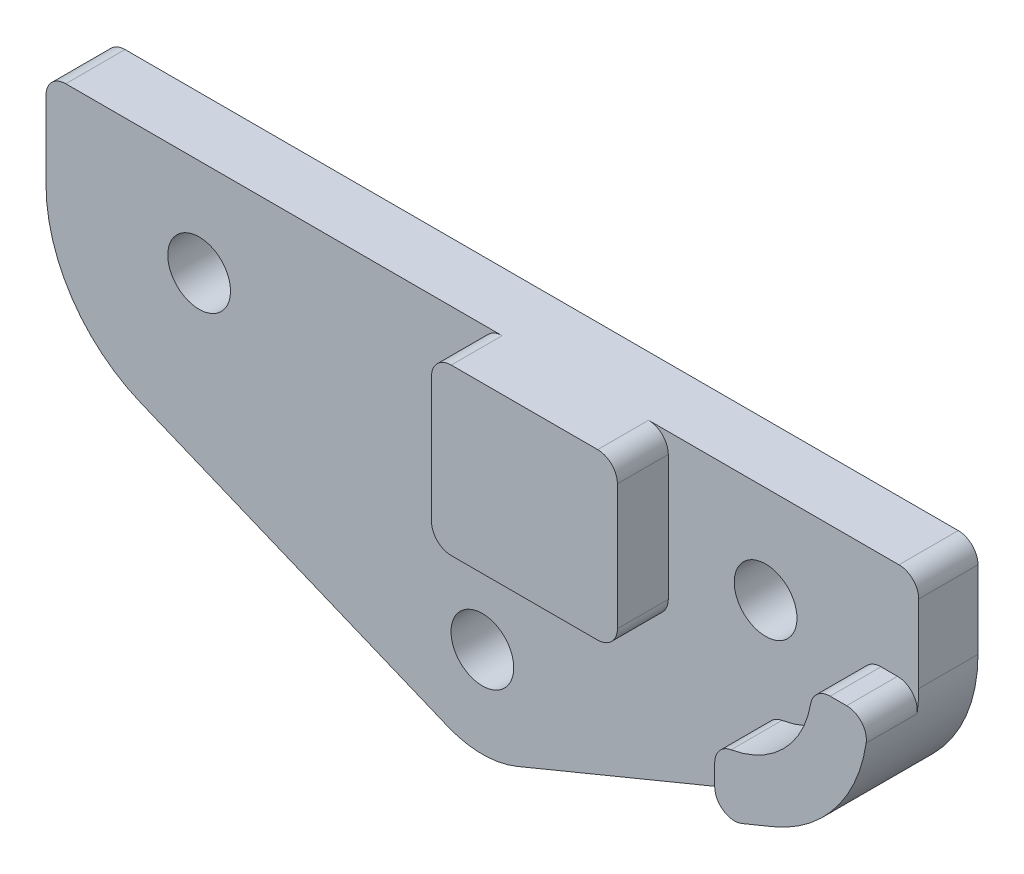
ISO-10303-21;
HEADER;
FILE_DESCRIPTION(('STEP AP214'),'2;1');
FILE_NAME('part.step','',(''),(''),'','','');
FILE_SCHEMA(('AUTOMOTIVE_DESIGN { 1 0 10303 214 1 1 1 1 }'));
ENDSEC;
DATA;
#1=APPLICATION_CONTEXT('core data for automotive mechanical design processes');
#2=APPLICATION_PROTOCOL_DEFINITION('international standard','automotive_design',2000,#1);
#3=PRODUCT_CONTEXT('',#1,'mechanical');
#4=PRODUCT('Part','Part','',(#3));
#5=PRODUCT_RELATED_PRODUCT_CATEGORY('part','',(#4));
#6=PRODUCT_DEFINITION_FORMATION('','',#4);
#7=PRODUCT_DEFINITION_CONTEXT('part definition',#1,'design');
#8=PRODUCT_DEFINITION('design','',#6,#7);
#9=PRODUCT_DEFINITION_SHAPE('','',#8);
#10=(LENGTH_UNIT() NAMED_UNIT(*) SI_UNIT(.MILLI.,.METRE.));
#11=(NAMED_UNIT(*) PLANE_ANGLE_UNIT() SI_UNIT($,.RADIAN.));
#12=(NAMED_UNIT(*) SI_UNIT($,.STERADIAN.) SOLID_ANGLE_UNIT());
#13=UNCERTAINTY_MEASURE_WITH_UNIT(LENGTH_MEASURE(1.E-05),#10,'distance_accuracy_value','');
#14=(GEOMETRIC_REPRESENTATION_CONTEXT(3) GLOBAL_UNCERTAINTY_ASSIGNED_CONTEXT((#13)) GLOBAL_UNIT_ASSIGNED_CONTEXT((#10,
#11,#12)) REPRESENTATION_CONTEXT('',''));
#15=CARTESIAN_POINT('',(0.,0.,0.));
#16=DIRECTION('',(0.,0.,1.));
#17=DIRECTION('',(1.,0.,0.));
#18=AXIS2_PLACEMENT_3D('',#15,#16,#17);
#19=CARTESIAN_POINT('',(14.335,9.3375,3.));
#20=DIRECTION('',(0.,0.,-1.));
#21=DIRECTION('',(-1.,0.,0.));
#22=AXIS2_PLACEMENT_3D('',#19,#20,#21);
#23=PLANE('',#22);
#24=CARTESIAN_POINT('',(14.335,9.3375,3.));
#25=DIRECTION('',(0.,0.,1.));
#26=DIRECTION('',(1.,0.,0.));
#27=AXIS2_PLACEMENT_3D('',#24,#25,#26);
#28=CIRCLE('',#27,1.5875);
#29=CARTESIAN_POINT('',(15.9225,9.3375,3.));
#30=VERTEX_POINT('',#29);
#31=EDGE_CURVE('E790',#30,#30,#28,.T.);
#32=ORIENTED_EDGE('',*,*,#31,.F.);
#33=EDGE_LOOP('',(#32));
#34=FACE_BOUND('',#33,.T.);
#35=CARTESIAN_POINT('',(0.,0.,3.));
#36=DIRECTION('',(0.,0.,1.));
#37=DIRECTION('',(1.,0.,0.));
#38=AXIS2_PLACEMENT_3D('',#35,#36,#37);
#39=CIRCLE('',#38,1.5875);
#40=CARTESIAN_POINT('',(1.5875,0.,3.));
#41=VERTEX_POINT('',#40);
#42=EDGE_CURVE('E309',#41,#41,#39,.T.);
#43=ORIENTED_EDGE('',*,*,#42,.F.);
#44=EDGE_LOOP('',(#43));
#45=FACE_BOUND('',#44,.T.);
#46=CARTESIAN_POINT('',(-14.335,9.3375,3.));
#47=DIRECTION('',(0.,0.,1.));
#48=DIRECTION('',(-1.,0.,0.));
#49=AXIS2_PLACEMENT_3D('',#46,#47,#48);
#50=CIRCLE('',#49,1.5875);
#51=CARTESIAN_POINT('',(-15.9225,9.3375,3.));
#52=VERTEX_POINT('',#51);
#53=EDGE_CURVE('E268',#52,#52,#50,.T.);
#54=ORIENTED_EDGE('',*,*,#53,.F.);
#55=EDGE_LOOP('',(#54));
#56=FACE_BOUND('',#55,.T.);
#57=DIRECTION('',(0.,1.,0.));
#58=VECTOR('',#57,1.);
#59=CARTESIAN_POINT('',(22.085,9.3375,3.));
#60=LINE('',#59,#58);
#61=CARTESIAN_POINT('',(22.085,9.3375,3.));
#62=VERTEX_POINT('',#61);
#63=CARTESIAN_POINT('',(22.085,13.2625,3.));
#64=VERTEX_POINT('',#63);
#65=EDGE_CURVE('E295',#62,#64,#60,.T.);
#66=ORIENTED_EDGE('',*,*,#65,.T.);
#67=CARTESIAN_POINT('',(21.085,13.2625,3.));
#68=DIRECTION('',(0.,0.,-1.));
#69=DIRECTION('',(-1.,0.,0.));
#70=AXIS2_PLACEMENT_3D('',#67,#68,#69);
#71=CIRCLE('',#70,1.);
#72=CARTESIAN_POINT('',(21.085,14.2625,3.));
#73=VERTEX_POINT('',#72);
#74=EDGE_CURVE('E355',#64,#73,#71,.F.);
#75=ORIENTED_EDGE('',*,*,#74,.T.);
#76=DIRECTION('',(-1.,0.,0.));
#77=VECTOR('',#76,1.);
#78=CARTESIAN_POINT('',(-22.085,14.2625,3.));
#79=LINE('',#78,#77);
#80=CARTESIAN_POINT('',(8.41,14.2625,3.));
#81=VERTEX_POINT('',#80);
#82=EDGE_CURVE('E287',#73,#81,#79,.T.);
#83=ORIENTED_EDGE('',*,*,#82,.T.);
#84=CARTESIAN_POINT('',(8.41,13.2625,3.));
#85=DIRECTION('',(0.,0.,-1.));
#86=DIRECTION('',(-1.,0.,0.));
#87=AXIS2_PLACEMENT_3D('',#84,#85,#86);
#88=CIRCLE('',#87,1.);
#89=CARTESIAN_POINT('',(9.41,13.2625,3.));
#90=VERTEX_POINT('',#89);
#91=EDGE_CURVE('E422',#81,#90,#88,.T.);
#92=ORIENTED_EDGE('',*,*,#91,.T.);
#93=DIRECTION('',(0.,1.,0.));
#94=VECTOR('',#93,1.);
#95=CARTESIAN_POINT('',(9.41,14.2625,3.));
#96=LINE('',#95,#94);
#97=CARTESIAN_POINT('',(9.41,6.91249999999999,3.));
#98=VERTEX_POINT('',#97);
#99=EDGE_CURVE('E253',#98,#90,#96,.T.);
#100=ORIENTED_EDGE('',*,*,#99,.F.);
#101=CARTESIAN_POINT('',(8.41,6.91249999999999,3.));
#102=DIRECTION('',(0.,0.,-1.));
#103=DIRECTION('',(-1.,0.,0.));
#104=AXIS2_PLACEMENT_3D('',#101,#102,#103);
#105=CIRCLE('',#104,1.);
#106=CARTESIAN_POINT('',(8.41,5.91249999999999,3.));
#107=VERTEX_POINT('',#106);
#108=EDGE_CURVE('E424',#98,#107,#105,.T.);
#109=ORIENTED_EDGE('',*,*,#108,.T.);
#110=DIRECTION('',(1.,0.,0.));
#111=VECTOR('',#110,1.);
#112=CARTESIAN_POINT('',(0.,5.91249999999999,3.));
#113=LINE('',#112,#111);
#114=CARTESIAN_POINT('',(1.,5.91249999999999,3.));
#115=VERTEX_POINT('',#114);
#116=EDGE_CURVE('E263',#115,#107,#113,.T.);
#117=ORIENTED_EDGE('',*,*,#116,.F.);
#118=CARTESIAN_POINT('',(1.,6.91249999999999,3.));
#119=DIRECTION('',(0.,0.,-1.));
#120=DIRECTION('',(-1.,0.,0.));
#121=AXIS2_PLACEMENT_3D('',#118,#119,#120);
#122=CIRCLE('',#121,1.);
#123=CARTESIAN_POINT('',(0.,6.91249999999999,3.));
#124=VERTEX_POINT('',#123);
#125=EDGE_CURVE('E417',#115,#124,#122,.T.);
#126=ORIENTED_EDGE('',*,*,#125,.T.);
#127=DIRECTION('',(0.,-1.,0.));
#128=VECTOR('',#127,1.);
#129=CARTESIAN_POINT('',(0.,14.2625,3.));
#130=LINE('',#129,#128);
#131=CARTESIAN_POINT('',(0.,13.2625,3.));
#132=VERTEX_POINT('',#131);
#133=EDGE_CURVE('E235',#132,#124,#130,.T.);
#134=ORIENTED_EDGE('',*,*,#133,.F.);
#135=CARTESIAN_POINT('',(1.,13.2625,3.));
#136=DIRECTION('',(0.,0.,-1.));
#137=DIRECTION('',(-1.,0.,0.));
#138=AXIS2_PLACEMENT_3D('',#135,#136,#137);
#139=CIRCLE('',#138,1.);
#140=CARTESIAN_POINT('',(1.,14.2625,3.));
#141=VERTEX_POINT('',#140);
#142=EDGE_CURVE('E419',#132,#141,#139,.T.);
#143=ORIENTED_EDGE('',*,*,#142,.T.);
#144=CARTESIAN_POINT('',(-21.085,14.2625,3.));
#145=VERTEX_POINT('',#144);
#146=EDGE_CURVE('E284',#141,#145,#79,.T.);
#147=ORIENTED_EDGE('',*,*,#146,.T.);
#148=CARTESIAN_POINT('',(-21.085,13.2625,3.));
#149=DIRECTION('',(0.,0.,-1.));
#150=DIRECTION('',(-1.,0.,0.));
#151=AXIS2_PLACEMENT_3D('',#148,#149,#150);
#152=CIRCLE('',#151,1.);
#153=CARTESIAN_POINT('',(-22.085,13.2625,3.));
#154=VERTEX_POINT('',#153);
#155=EDGE_CURVE('E279',#145,#154,#152,.F.);
#156=ORIENTED_EDGE('',*,*,#155,.T.);
#157=DIRECTION('',(0.,-1.,0.));
#158=VECTOR('',#157,1.);
#159=CARTESIAN_POINT('',(-22.085,9.33749999999999,3.));
#160=LINE('',#159,#158);
#161=CARTESIAN_POINT('',(-22.085,9.33749999999999,3.));
#162=VERTEX_POINT('',#161);
#163=EDGE_CURVE('E289',#154,#162,#160,.T.);
#164=ORIENTED_EDGE('',*,*,#163,.T.);
#165=CARTESIAN_POINT('',(-14.335,9.3375,3.));
#166=DIRECTION('',(0.,0.,1.));
#167=DIRECTION('',(1.,0.,0.));
#168=AXIS2_PLACEMENT_3D('',#165,#166,#167);
#169=CIRCLE('',#168,7.75);
#170=CARTESIAN_POINT('',(-17.2916213916984,2.1736400107099,3.));
#171=VERTEX_POINT('',#170);
#172=EDGE_CURVE('E299',#162,#171,#169,.T.);
#173=ORIENTED_EDGE('',*,*,#172,.T.);
#174=DIRECTION('',(0.924369030876142,-0.381499534412694,0.));
#175=VECTOR('',#174,1.);
#176=CARTESIAN_POINT('',(-1.75012911411824,-4.2405429291443,3.));
#177=LINE('',#176,#175);
#178=CARTESIAN_POINT('',(-1.75012911411824,-4.2405429291443,3.));
#179=VERTEX_POINT('',#178);
#180=EDGE_CURVE('E301',#171,#179,#177,.T.);
#181=ORIENTED_EDGE('',*,*,#180,.T.);
#182=CARTESIAN_POINT('',(0.,0.,3.));
#183=DIRECTION('',(0.,0.,1.));
#184=DIRECTION('',(1.,0.,0.));
#185=AXIS2_PLACEMENT_3D('',#182,#183,#184);
#186=CIRCLE('',#185,4.5875);
#187=CARTESIAN_POINT('',(1.75012911411823,-4.2405429291443,3.));
#188=VERTEX_POINT('',#187);
#189=EDGE_CURVE('E303',#179,#188,#186,.T.);
#190=ORIENTED_EDGE('',*,*,#189,.T.);
#191=DIRECTION('',(0.924369030876142,0.381499534412694,0.));
#192=VECTOR('',#191,1.);
#193=CARTESIAN_POINT('',(1.75012911411824,-4.2405429291443,3.));
#194=LINE('',#193,#192);
#195=CARTESIAN_POINT('',(15.7164995344127,1.5235660303774,3.));
#196=VERTEX_POINT('',#195);
#197=EDGE_CURVE('E54',#188,#196,#194,.T.);
#198=ORIENTED_EDGE('',*,*,#197,.T.);
#199=CARTESIAN_POINT('',(15.335,2.44793506125354,3.));
#200=DIRECTION('',(0.,0.,-1.));
#201=DIRECTION('',(-1.,0.,0.));
#202=AXIS2_PLACEMENT_3D('',#199,#200,#201);
#203=CIRCLE('',#202,1.);
#204=CARTESIAN_POINT('',(14.335,2.44793506125354,3.));
#205=VERTEX_POINT('',#204);
#206=EDGE_CURVE('E40',#196,#205,#203,.T.);
#207=ORIENTED_EDGE('',*,*,#206,.T.);
#208=DIRECTION('',(0.,-1.,0.));
#209=VECTOR('',#208,1.);
#210=CARTESIAN_POINT('',(14.335,4.41249999999999,3.));
#211=LINE('',#210,#209);
#212=CARTESIAN_POINT('',(14.335,3.49749785958943,3.));
#213=VERTEX_POINT('',#212);
#214=EDGE_CURVE('E242',#213,#205,#211,.T.);
#215=ORIENTED_EDGE('',*,*,#214,.F.);
#216=CARTESIAN_POINT('',(15.335,3.49749785958943,3.));
#217=DIRECTION('',(0.,0.,-1.));
#218=DIRECTION('',(-1.,0.,0.));
#219=AXIS2_PLACEMENT_3D('',#216,#217,#218);
#220=CIRCLE('',#219,1.);
#221=CARTESIAN_POINT('',(15.166223628692,4.48315222927897,3.));
#222=VERTEX_POINT('',#221);
#223=EDGE_CURVE('E11',#213,#222,#220,.T.);
#224=ORIENTED_EDGE('',*,*,#223,.T.);
#225=CARTESIAN_POINT('',(14.335,9.3375,3.));
#226=DIRECTION('',(0.,0.,-1.));
#227=DIRECTION('',(-1.,0.,0.));
#228=AXIS2_PLACEMENT_3D('',#225,#226,#227);
#229=CIRCLE('',#228,4.92500000000001);
#230=CARTESIAN_POINT('',(19.189347770721,8.50627637130802,3.));
#231=VERTEX_POINT('',#230);
#232=EDGE_CURVE('E239',#231,#222,#229,.T.);
#233=ORIENTED_EDGE('',*,*,#232,.F.);
#234=CARTESIAN_POINT('',(20.1750021404106,8.3375,3.));
#235=DIRECTION('',(0.,0.,-1.));
#236=DIRECTION('',(-1.,0.,0.));
#237=AXIS2_PLACEMENT_3D('',#234,#235,#236);
#238=CIRCLE('',#237,1.);
#239=CARTESIAN_POINT('',(20.1750021404106,9.3375,3.));
#240=VERTEX_POINT('',#239);
#241=EDGE_CURVE('E415',#231,#240,#238,.T.);
#242=ORIENTED_EDGE('',*,*,#241,.T.);
#243=DIRECTION('',(-1.,0.,0.));
#244=VECTOR('',#243,1.);
#245=CARTESIAN_POINT('',(19.26,9.3375,3.));
#246=LINE('',#245,#244);
#247=CARTESIAN_POINT('',(21.0105149614093,9.3375,3.));
#248=VERTEX_POINT('',#247);
#249=EDGE_CURVE('E245',#248,#240,#246,.T.);
#250=ORIENTED_EDGE('',*,*,#249,.F.);
#251=CARTESIAN_POINT('',(21.0105149614093,8.3375,3.));
#252=DIRECTION('',(0.,0.,-1.));
#253=DIRECTION('',(-1.,0.,0.));
#254=AXIS2_PLACEMENT_3D('',#251,#252,#253);
#255=CIRCLE('',#254,1.);
#256=CARTESIAN_POINT('',(21.9994801408774,8.18935185185185,3.));
#257=VERTEX_POINT('',#256);
#258=EDGE_CURVE('E413',#248,#257,#255,.T.);
#259=ORIENTED_EDGE('',*,*,#258,.T.);
#260=CARTESIAN_POINT('',(14.335,9.3375,3.));
#261=DIRECTION('',(0.,0.,-1.));
#262=DIRECTION('',(-1.,0.,0.));
#263=AXIS2_PLACEMENT_3D('',#260,#261,#262);
#264=CIRCLE('',#263,7.75);
#265=EDGE_CURVE('E47',#62,#257,#264,.T.);
#266=ORIENTED_EDGE('',*,*,#265,.F.);
#267=EDGE_LOOP('',(#66,#75,#83,#92,#100,#109,#117,#126,#134,#143,#147,#156,#164,#173,#181,#190,
#198,#207,#215,#224,#233,#242,#250,#259,#266));
#268=FACE_BOUND('',#267,.T.);
#269=ADVANCED_FACE('F32',(#34,#45,#56,#268),#23,.F.);
#270=CARTESIAN_POINT('',(14.335,9.3375,0.));
#271=DIRECTION('',(0.,0.,-1.));
#272=DIRECTION('',(-1.,0.,0.));
#273=AXIS2_PLACEMENT_3D('',#270,#271,#272);
#274=PLANE('',#273);
#275=CARTESIAN_POINT('',(14.335,9.3375,0.));
#276=DIRECTION('',(0.,0.,1.));
#277=DIRECTION('',(1.,0.,0.));
#278=AXIS2_PLACEMENT_3D('',#275,#276,#277);
#279=CIRCLE('',#278,1.5875);
#280=CARTESIAN_POINT('',(15.9225,9.3375,0.));
#281=VERTEX_POINT('',#280);
#282=EDGE_CURVE('E788',#281,#281,#279,.T.);
#283=ORIENTED_EDGE('',*,*,#282,.T.);
#284=EDGE_LOOP('',(#283));
#285=FACE_BOUND('',#284,.T.);
#286=DIRECTION('',(-1.,0.,0.));
#287=VECTOR('',#286,1.);
#288=CARTESIAN_POINT('',(-22.085,14.2625,0.));
#289=LINE('',#288,#287);
#290=CARTESIAN_POINT('',(21.085,14.2625,0.));
#291=VERTEX_POINT('',#290);
#292=CARTESIAN_POINT('',(-21.085,14.2625,0.));
#293=VERTEX_POINT('',#292);
#294=EDGE_CURVE('E312',#291,#293,#289,.T.);
#295=ORIENTED_EDGE('',*,*,#294,.F.);
#296=CARTESIAN_POINT('',(21.085,13.2625,0.));
#297=DIRECTION('',(0.,0.,-1.));
#298=DIRECTION('',(-1.,0.,0.));
#299=AXIS2_PLACEMENT_3D('',#296,#297,#298);
#300=CIRCLE('',#299,1.);
#301=CARTESIAN_POINT('',(22.085,13.2625,0.));
#302=VERTEX_POINT('',#301);
#303=EDGE_CURVE('E351',#291,#302,#300,.T.);
#304=ORIENTED_EDGE('',*,*,#303,.T.);
#305=DIRECTION('',(0.,1.,0.));
#306=VECTOR('',#305,1.);
#307=CARTESIAN_POINT('',(22.085,9.3375,0.));
#308=LINE('',#307,#306);
#309=CARTESIAN_POINT('',(22.085,9.3375,0.));
#310=VERTEX_POINT('',#309);
#311=EDGE_CURVE('E308',#310,#302,#308,.T.);
#312=ORIENTED_EDGE('',*,*,#311,.F.);
#313=CARTESIAN_POINT('',(14.335,9.3375,0.));
#314=DIRECTION('',(0.,0.,1.));
#315=DIRECTION('',(-1.,0.,0.));
#316=AXIS2_PLACEMENT_3D('',#313,#314,#315);
#317=CIRCLE('',#316,7.75);
#318=CARTESIAN_POINT('',(17.2916213916984,2.1736400107099,0.));
#319=VERTEX_POINT('',#318);
#320=EDGE_CURVE('E306',#319,#310,#317,.T.);
#321=ORIENTED_EDGE('',*,*,#320,.F.);
#322=DIRECTION('',(0.924369030876142,0.381499534412694,0.));
#323=VECTOR('',#322,1.);
#324=CARTESIAN_POINT('',(1.75012911411824,-4.2405429291443,0.));
#325=LINE('',#324,#323);
#326=CARTESIAN_POINT('',(1.75012911411823,-4.2405429291443,0.));
#327=VERTEX_POINT('',#326);
#328=EDGE_CURVE('E223',#327,#319,#325,.T.);
#329=ORIENTED_EDGE('',*,*,#328,.F.);
#330=CARTESIAN_POINT('',(0.,0.,0.));
#331=DIRECTION('',(0.,0.,1.));
#332=DIRECTION('',(1.,0.,0.));
#333=AXIS2_PLACEMENT_3D('',#330,#331,#332);
#334=CIRCLE('',#333,4.5875);
#335=CARTESIAN_POINT('',(-1.75012911411824,-4.2405429291443,0.));
#336=VERTEX_POINT('',#335);
#337=EDGE_CURVE('E321',#336,#327,#334,.T.);
#338=ORIENTED_EDGE('',*,*,#337,.F.);
#339=DIRECTION('',(0.924369030876142,-0.381499534412694,0.));
#340=VECTOR('',#339,1.);
#341=CARTESIAN_POINT('',(-1.75012911411824,-4.2405429291443,0.));
#342=LINE('',#341,#340);
#343=CARTESIAN_POINT('',(-17.2916213916984,2.1736400107099,0.));
#344=VERTEX_POINT('',#343);
#345=EDGE_CURVE('E319',#344,#336,#342,.T.);
#346=ORIENTED_EDGE('',*,*,#345,.F.);
#347=CARTESIAN_POINT('',(-14.335,9.3375,0.));
#348=DIRECTION('',(0.,0.,1.));
#349=DIRECTION('',(1.,0.,0.));
#350=AXIS2_PLACEMENT_3D('',#347,#348,#349);
#351=CIRCLE('',#350,7.75);
#352=CARTESIAN_POINT('',(-22.085,9.33749999999999,0.));
#353=VERTEX_POINT('',#352);
#354=EDGE_CURVE('E317',#353,#344,#351,.T.);
#355=ORIENTED_EDGE('',*,*,#354,.F.);
#356=DIRECTION('',(0.,-1.,0.));
#357=VECTOR('',#356,1.);
#358=CARTESIAN_POINT('',(-22.085,9.33749999999999,0.));
#359=LINE('',#358,#357);
#360=CARTESIAN_POINT('',(-22.085,13.2625,0.));
#361=VERTEX_POINT('',#360);
#362=EDGE_CURVE('E315',#361,#353,#359,.T.);
#363=ORIENTED_EDGE('',*,*,#362,.F.);
#364=CARTESIAN_POINT('',(-21.085,13.2625,0.));
#365=DIRECTION('',(0.,0.,-1.));
#366=DIRECTION('',(-1.,0.,0.));
#367=AXIS2_PLACEMENT_3D('',#364,#365,#366);
#368=CIRCLE('',#367,1.);
#369=EDGE_CURVE('E350',#361,#293,#368,.T.);
#370=ORIENTED_EDGE('',*,*,#369,.T.);
#371=EDGE_LOOP('',(#295,#304,#312,#321,#329,#338,#346,#355,#363,#370));
#372=FACE_BOUND('',#371,.T.);
#373=CARTESIAN_POINT('',(0.,0.,0.));
#374=DIRECTION('',(0.,0.,1.));
#375=DIRECTION('',(1.,0.,0.));
#376=AXIS2_PLACEMENT_3D('',#373,#374,#375);
#377=CIRCLE('',#376,1.5875);
#378=CARTESIAN_POINT('',(1.5875,0.,0.));
#379=VERTEX_POINT('',#378);
#380=EDGE_CURVE('E793',#379,#379,#377,.T.);
#381=ORIENTED_EDGE('',*,*,#380,.T.);
#382=EDGE_LOOP('',(#381));
#383=FACE_BOUND('',#382,.T.);
#384=CARTESIAN_POINT('',(-14.335,9.3375,0.));
#385=DIRECTION('',(0.,0.,1.));
#386=DIRECTION('',(-1.,0.,0.));
#387=AXIS2_PLACEMENT_3D('',#384,#385,#386);
#388=CIRCLE('',#387,1.5875);
#389=CARTESIAN_POINT('',(-15.9225,9.3375,0.));
#390=VERTEX_POINT('',#389);
#391=EDGE_CURVE('E262',#390,#390,#388,.T.);
#392=ORIENTED_EDGE('',*,*,#391,.T.);
#393=EDGE_LOOP('',(#392));
#394=FACE_BOUND('',#393,.T.);
#395=ADVANCED_FACE('F437',(#285,#372,#383,#394),#274,.T.);
#396=CARTESIAN_POINT('',(14.335,9.3375,3.));
#397=DIRECTION('',(0.,0.,-1.));
#398=DIRECTION('',(-1.,0.,0.));
#399=AXIS2_PLACEMENT_3D('',#396,#397,#398);
#400=CYLINDRICAL_SURFACE('',#399,7.75);
#401=DIRECTION('',(0.,0.,-1.));
#402=VECTOR('',#401,1.);
#403=CARTESIAN_POINT('',(22.085,9.3375,3.));
#404=LINE('',#403,#402);
#405=EDGE_CURVE('E333',#62,#310,#404,.T.);
#406=ORIENTED_EDGE('',*,*,#405,.F.);
#407=ORIENTED_EDGE('',*,*,#265,.T.);
#408=DIRECTION('',(0.,0.,-1.));
#409=VECTOR('',#408,1.);
#410=CARTESIAN_POINT('',(21.9994801408774,8.18935185185185,3.));
#411=LINE('',#410,#409);
#412=CARTESIAN_POINT('',(21.9994801408774,8.18935185185185,5.575));
#413=VERTEX_POINT('',#412);
#414=EDGE_CURVE('E231',#257,#413,#411,.F.);
#415=ORIENTED_EDGE('',*,*,#414,.T.);
#416=CARTESIAN_POINT('',(14.335,9.3375,5.575));
#417=DIRECTION('',(0.,0.,1.));
#418=DIRECTION('',(1.,0.,0.));
#419=AXIS2_PLACEMENT_3D('',#416,#417,#418);
#420=CIRCLE('',#419,7.75);
#421=CARTESIAN_POINT('',(17.2916213916984,2.1736400107099,5.575));
#422=VERTEX_POINT('',#421);
#423=EDGE_CURVE('E208',#422,#413,#420,.T.);
#424=ORIENTED_EDGE('',*,*,#423,.F.);
#425=DIRECTION('',(0.,0.,-1.));
#426=VECTOR('',#425,1.);
#427=CARTESIAN_POINT('',(17.2916213916984,2.1736400107099,3.));
#428=LINE('',#427,#426);
#429=EDGE_CURVE('E219',#422,#319,#428,.T.);
#430=ORIENTED_EDGE('',*,*,#429,.T.);
#431=ORIENTED_EDGE('',*,*,#320,.T.);
#432=EDGE_LOOP('',(#406,#407,#415,#424,#430,#431));
#433=FACE_BOUND('',#432,.T.);
#434=ADVANCED_FACE('F229',(#433),#400,.T.);
#435=CARTESIAN_POINT('',(22.085,9.3375,3.));
#436=DIRECTION('',(-1.,0.,0.));
#437=DIRECTION('',(0.,0.,1.));
#438=AXIS2_PLACEMENT_3D('',#435,#436,#437);
#439=PLANE('',#438);
#440=ORIENTED_EDGE('',*,*,#311,.T.);
#441=DIRECTION('',(0.,0.,-1.));
#442=VECTOR('',#441,1.);
#443=CARTESIAN_POINT('',(22.085,13.2625,3.));
#444=LINE('',#443,#442);
#445=EDGE_CURVE('E274',#302,#64,#444,.F.);
#446=ORIENTED_EDGE('',*,*,#445,.T.);
#447=ORIENTED_EDGE('',*,*,#65,.F.);
#448=ORIENTED_EDGE('',*,*,#405,.T.);
#449=EDGE_LOOP('',(#440,#446,#447,#448));
#450=FACE_BOUND('',#449,.T.);
#451=ADVANCED_FACE('F440',(#450),#439,.F.);
#452=CARTESIAN_POINT('',(-22.085,14.2625,3.));
#453=DIRECTION('',(0.,-1.,0.));
#454=DIRECTION('',(0.,0.,-1.));
#455=AXIS2_PLACEMENT_3D('',#452,#453,#454);
#456=PLANE('',#455);
#457=ORIENTED_EDGE('',*,*,#82,.F.);
#458=DIRECTION('',(0.,0.,-1.));
#459=VECTOR('',#458,1.);
#460=CARTESIAN_POINT('',(21.085,14.2625,3.));
#461=LINE('',#460,#459);
#462=EDGE_CURVE('E345',#73,#291,#461,.T.);
#463=ORIENTED_EDGE('',*,*,#462,.T.);
#464=ORIENTED_EDGE('',*,*,#294,.T.);
#465=DIRECTION('',(0.,0.,-1.));
#466=VECTOR('',#465,1.);
#467=CARTESIAN_POINT('',(-21.085,14.2625,3.));
#468=LINE('',#467,#466);
#469=EDGE_CURVE('E343',#293,#145,#468,.F.);
#470=ORIENTED_EDGE('',*,*,#469,.T.);
#471=ORIENTED_EDGE('',*,*,#146,.F.);
#472=DIRECTION('',(0.,0.,-1.));
#473=VECTOR('',#472,1.);
#474=CARTESIAN_POINT('',(1.,14.2625,3.));
#475=LINE('',#474,#473);
#476=CARTESIAN_POINT('',(1.,14.2625,5.575));
#477=VERTEX_POINT('',#476);
#478=EDGE_CURVE('E338',#141,#477,#475,.F.);
#479=ORIENTED_EDGE('',*,*,#478,.T.);
#480=DIRECTION('',(-1.,0.,0.));
#481=VECTOR('',#480,1.);
#482=CARTESIAN_POINT('',(0.,14.2625,5.575));
#483=LINE('',#482,#481);
#484=CARTESIAN_POINT('',(8.41,14.2625,5.575));
#485=VERTEX_POINT('',#484);
#486=EDGE_CURVE('E259',#485,#477,#483,.T.);
#487=ORIENTED_EDGE('',*,*,#486,.F.);
#488=DIRECTION('',(0.,0.,-1.));
#489=VECTOR('',#488,1.);
#490=CARTESIAN_POINT('',(8.41,14.2625,3.));
#491=LINE('',#490,#489);
#492=EDGE_CURVE('E290',#485,#81,#491,.T.);
#493=ORIENTED_EDGE('',*,*,#492,.T.);
#494=EDGE_LOOP('',(#457,#463,#464,#470,#471,#479,#487,#493));
#495=FACE_BOUND('',#494,.T.);
#496=ADVANCED_FACE('F686',(#495),#456,.F.);
#497=CARTESIAN_POINT('',(-22.085,9.33749999999999,3.));
#498=DIRECTION('',(1.,0.,0.));
#499=DIRECTION('',(0.,0.,-1.));
#500=AXIS2_PLACEMENT_3D('',#497,#498,#499);
#501=PLANE('',#500);
#502=ORIENTED_EDGE('',*,*,#163,.F.);
#503=DIRECTION('',(0.,0.,-1.));
#504=VECTOR('',#503,1.);
#505=CARTESIAN_POINT('',(-22.085,13.2625,3.));
#506=LINE('',#505,#504);
#507=EDGE_CURVE('E359',#154,#361,#506,.T.);
#508=ORIENTED_EDGE('',*,*,#507,.T.);
#509=ORIENTED_EDGE('',*,*,#362,.T.);
#510=DIRECTION('',(0.,0.,-1.));
#511=VECTOR('',#510,1.);
#512=CARTESIAN_POINT('',(-22.085,9.33749999999999,3.));
#513=LINE('',#512,#511);
#514=EDGE_CURVE('E331',#162,#353,#513,.T.);
#515=ORIENTED_EDGE('',*,*,#514,.F.);
#516=EDGE_LOOP('',(#502,#508,#509,#515));
#517=FACE_BOUND('',#516,.T.);
#518=ADVANCED_FACE('F448',(#517),#501,.F.);
#519=CARTESIAN_POINT('',(-14.335,9.3375,3.));
#520=DIRECTION('',(0.,0.,-1.));
#521=DIRECTION('',(-1.,0.,0.));
#522=AXIS2_PLACEMENT_3D('',#519,#520,#521);
#523=CYLINDRICAL_SURFACE('',#522,7.75);
#524=ORIENTED_EDGE('',*,*,#354,.T.);
#525=DIRECTION('',(0.,0.,-1.));
#526=VECTOR('',#525,1.);
#527=CARTESIAN_POINT('',(-17.2916213916984,2.1736400107099,3.));
#528=LINE('',#527,#526);
#529=EDGE_CURVE('E328',#171,#344,#528,.T.);
#530=ORIENTED_EDGE('',*,*,#529,.F.);
#531=ORIENTED_EDGE('',*,*,#172,.F.);
#532=ORIENTED_EDGE('',*,*,#514,.T.);
#533=EDGE_LOOP('',(#524,#530,#531,#532));
#534=FACE_BOUND('',#533,.T.);
#535=ADVANCED_FACE('F453',(#534),#523,.T.);
#536=CARTESIAN_POINT('',(-1.75012911411824,-4.2405429291443,3.));
#537=DIRECTION('',(0.381499534412694,0.924369030876142,0.));
#538=DIRECTION('',(-0.924369030876142,0.381499534412694,0.));
#539=AXIS2_PLACEMENT_3D('',#536,#537,#538);
#540=PLANE('',#539);
#541=ORIENTED_EDGE('',*,*,#345,.T.);
#542=DIRECTION('',(0.,0.,-1.));
#543=VECTOR('',#542,1.);
#544=CARTESIAN_POINT('',(-1.75012911411824,-4.2405429291443,3.));
#545=LINE('',#544,#543);
#546=EDGE_CURVE('E325',#179,#336,#545,.T.);
#547=ORIENTED_EDGE('',*,*,#546,.F.);
#548=ORIENTED_EDGE('',*,*,#180,.F.);
#549=ORIENTED_EDGE('',*,*,#529,.T.);
#550=EDGE_LOOP('',(#541,#547,#548,#549));
#551=FACE_BOUND('',#550,.T.);
#552=ADVANCED_FACE('F457',(#551),#540,.F.);
#553=CARTESIAN_POINT('',(0.,0.,3.));
#554=DIRECTION('',(0.,0.,-1.));
#555=DIRECTION('',(-1.,0.,0.));
#556=AXIS2_PLACEMENT_3D('',#553,#554,#555);
#557=CYLINDRICAL_SURFACE('',#556,4.5875);
#558=ORIENTED_EDGE('',*,*,#337,.T.);
#559=DIRECTION('',(0.,0.,-1.));
#560=VECTOR('',#559,1.);
#561=CARTESIAN_POINT('',(1.75012911411823,-4.2405429291443,3.));
#562=LINE('',#561,#560);
#563=EDGE_CURVE('E227',#188,#327,#562,.T.);
#564=ORIENTED_EDGE('',*,*,#563,.F.);
#565=ORIENTED_EDGE('',*,*,#189,.F.);
#566=ORIENTED_EDGE('',*,*,#546,.T.);
#567=EDGE_LOOP('',(#558,#564,#565,#566));
#568=FACE_BOUND('',#567,.T.);
#569=ADVANCED_FACE('F459',(#568),#557,.T.);
#570=CARTESIAN_POINT('',(1.75012911411824,-4.2405429291443,3.));
#571=DIRECTION('',(-0.381499534412694,0.924369030876142,0.));
#572=DIRECTION('',(-0.924369030876142,-0.381499534412694,0.));
#573=AXIS2_PLACEMENT_3D('',#570,#571,#572);
#574=PLANE('',#573);
#575=DIRECTION('',(0.924369030876142,0.381499534412694,0.));
#576=VECTOR('',#575,1.);
#577=CARTESIAN_POINT('',(17.2916213916984,2.1736400107099,5.575));
#578=LINE('',#577,#576);
#579=CARTESIAN_POINT('',(15.7164995344127,1.5235660303774,5.575));
#580=VERTEX_POINT('',#579);
#581=EDGE_CURVE('E204',#580,#422,#578,.T.);
#582=ORIENTED_EDGE('',*,*,#581,.F.);
#583=DIRECTION('',(0.,0.,-1.));
#584=VECTOR('',#583,1.);
#585=CARTESIAN_POINT('',(15.7164995344127,1.5235660303774,3.));
#586=LINE('',#585,#584);
#587=EDGE_CURVE('E406',#580,#196,#586,.T.);
#588=ORIENTED_EDGE('',*,*,#587,.T.);
#589=ORIENTED_EDGE('',*,*,#197,.F.);
#590=ORIENTED_EDGE('',*,*,#563,.T.);
#591=ORIENTED_EDGE('',*,*,#328,.T.);
#592=ORIENTED_EDGE('',*,*,#429,.F.);
#593=EDGE_LOOP('',(#582,#588,#589,#590,#591,#592));
#594=FACE_BOUND('',#593,.T.);
#595=ADVANCED_FACE('F220',(#594),#574,.F.);
#596=CARTESIAN_POINT('',(0.,0.,3.));
#597=DIRECTION('',(0.,0.,-1.));
#598=DIRECTION('',(-1.,0.,0.));
#599=AXIS2_PLACEMENT_3D('',#596,#597,#598);
#600=CYLINDRICAL_SURFACE('',#599,1.5875);
#601=ORIENTED_EDGE('',*,*,#42,.T.);
#602=EDGE_LOOP('',(#601));
#603=FACE_BOUND('',#602,.T.);
#604=ORIENTED_EDGE('',*,*,#380,.F.);
#605=EDGE_LOOP('',(#604));
#606=FACE_BOUND('',#605,.T.);
#607=ADVANCED_FACE('F466',(#603,#606),#600,.F.);
#608=CARTESIAN_POINT('',(14.335,9.3375,3.));
#609=DIRECTION('',(0.,0.,-1.));
#610=DIRECTION('',(-1.,0.,0.));
#611=AXIS2_PLACEMENT_3D('',#608,#609,#610);
#612=CYLINDRICAL_SURFACE('',#611,1.5875);
#613=ORIENTED_EDGE('',*,*,#31,.T.);
#614=EDGE_LOOP('',(#613));
#615=FACE_BOUND('',#614,.T.);
#616=ORIENTED_EDGE('',*,*,#282,.F.);
#617=EDGE_LOOP('',(#616));
#618=FACE_BOUND('',#617,.T.);
#619=ADVANCED_FACE('F482',(#615,#618),#612,.F.);
#620=CARTESIAN_POINT('',(-14.335,9.3375,3.));
#621=DIRECTION('',(0.,0.,-1.));
#622=DIRECTION('',(-1.,0.,0.));
#623=AXIS2_PLACEMENT_3D('',#620,#621,#622);
#624=CYLINDRICAL_SURFACE('',#623,1.5875);
#625=ORIENTED_EDGE('',*,*,#53,.T.);
#626=EDGE_LOOP('',(#625));
#627=FACE_BOUND('',#626,.T.);
#628=ORIENTED_EDGE('',*,*,#391,.F.);
#629=EDGE_LOOP('',(#628));
#630=FACE_BOUND('',#629,.T.);
#631=ADVANCED_FACE('F486',(#627,#630),#624,.F.);
#632=CARTESIAN_POINT('',(0.,14.2625,5.575));
#633=DIRECTION('',(1.,0.,0.));
#634=DIRECTION('',(0.,1.,0.));
#635=AXIS2_PLACEMENT_3D('',#632,#633,#634);
#636=PLANE('',#635);
#637=ORIENTED_EDGE('',*,*,#133,.T.);
#638=DIRECTION('',(0.,0.,-1.));
#639=VECTOR('',#638,1.);
#640=CARTESIAN_POINT('',(0.,6.91249999999999,5.575));
#641=LINE('',#640,#639);
#642=CARTESIAN_POINT('',(0.,6.91249999999999,5.575));
#643=VERTEX_POINT('',#642);
#644=EDGE_CURVE('E391',#124,#643,#641,.F.);
#645=ORIENTED_EDGE('',*,*,#644,.T.);
#646=DIRECTION('',(0.,-1.,0.));
#647=VECTOR('',#646,1.);
#648=CARTESIAN_POINT('',(0.,14.2625,5.575));
#649=LINE('',#648,#647);
#650=CARTESIAN_POINT('',(0.,13.2625,5.575));
#651=VERTEX_POINT('',#650);
#652=EDGE_CURVE('E249',#651,#643,#649,.T.);
#653=ORIENTED_EDGE('',*,*,#652,.F.);
#654=DIRECTION('',(0.,0.,-1.));
#655=VECTOR('',#654,1.);
#656=CARTESIAN_POINT('',(0.,13.2625,5.575));
#657=LINE('',#656,#655);
#658=EDGE_CURVE('E388',#651,#132,#657,.T.);
#659=ORIENTED_EDGE('',*,*,#658,.T.);
#660=EDGE_LOOP('',(#637,#645,#653,#659));
#661=FACE_BOUND('',#660,.T.);
#662=ADVANCED_FACE('F490',(#661),#636,.F.);
#663=CARTESIAN_POINT('',(0.,5.91249999999999,5.575));
#664=DIRECTION('',(0.,1.,0.));
#665=DIRECTION('',(0.,0.,1.));
#666=AXIS2_PLACEMENT_3D('',#663,#664,#665);
#667=PLANE('',#666);
#668=DIRECTION('',(1.,0.,0.));
#669=VECTOR('',#668,1.);
#670=CARTESIAN_POINT('',(0.,5.91249999999999,5.575));
#671=LINE('',#670,#669);
#672=CARTESIAN_POINT('',(1.,5.91249999999999,5.575));
#673=VERTEX_POINT('',#672);
#674=CARTESIAN_POINT('',(8.41,5.91249999999999,5.575));
#675=VERTEX_POINT('',#674);
#676=EDGE_CURVE('E252',#673,#675,#671,.T.);
#677=ORIENTED_EDGE('',*,*,#676,.F.);
#678=DIRECTION('',(0.,0.,-1.));
#679=VECTOR('',#678,1.);
#680=CARTESIAN_POINT('',(1.,5.91249999999999,5.575));
#681=LINE('',#680,#679);
#682=EDGE_CURVE('E385',#673,#115,#681,.T.);
#683=ORIENTED_EDGE('',*,*,#682,.T.);
#684=ORIENTED_EDGE('',*,*,#116,.T.);
#685=DIRECTION('',(0.,0.,-1.));
#686=VECTOR('',#685,1.);
#687=CARTESIAN_POINT('',(8.41,5.91249999999999,5.575));
#688=LINE('',#687,#686);
#689=EDGE_CURVE('E383',#107,#675,#688,.F.);
#690=ORIENTED_EDGE('',*,*,#689,.T.);
#691=EDGE_LOOP('',(#677,#683,#684,#690));
#692=FACE_BOUND('',#691,.T.);
#693=ADVANCED_FACE('F494',(#692),#667,.F.);
#694=CARTESIAN_POINT('',(9.41,14.2625,5.575));
#695=DIRECTION('',(-1.,0.,0.));
#696=DIRECTION('',(0.,-1.,0.));
#697=AXIS2_PLACEMENT_3D('',#694,#695,#696);
#698=PLANE('',#697);
#699=ORIENTED_EDGE('',*,*,#99,.T.);
#700=DIRECTION('',(0.,0.,-1.));
#701=VECTOR('',#700,1.);
#702=CARTESIAN_POINT('',(9.41,13.2625,5.575));
#703=LINE('',#702,#701);
#704=CARTESIAN_POINT('',(9.41,13.2625,5.575));
#705=VERTEX_POINT('',#704);
#706=EDGE_CURVE('E404',#90,#705,#703,.F.);
#707=ORIENTED_EDGE('',*,*,#706,.T.);
#708=DIRECTION('',(0.,1.,0.));
#709=VECTOR('',#708,1.);
#710=CARTESIAN_POINT('',(9.41,14.2625,5.575));
#711=LINE('',#710,#709);
#712=CARTESIAN_POINT('',(9.41,6.91249999999999,5.575));
#713=VERTEX_POINT('',#712);
#714=EDGE_CURVE('E256',#713,#705,#711,.T.);
#715=ORIENTED_EDGE('',*,*,#714,.F.);
#716=DIRECTION('',(0.,0.,-1.));
#717=VECTOR('',#716,1.);
#718=CARTESIAN_POINT('',(9.41,6.91249999999999,5.575));
#719=LINE('',#718,#717);
#720=EDGE_CURVE('E401',#713,#98,#719,.T.);
#721=ORIENTED_EDGE('',*,*,#720,.T.);
#722=EDGE_LOOP('',(#699,#707,#715,#721));
#723=FACE_BOUND('',#722,.T.);
#724=ADVANCED_FACE('F498',(#723),#698,.F.);
#725=CARTESIAN_POINT('',(0.,0.,5.575));
#726=DIRECTION('',(0.,0.,1.));
#727=DIRECTION('',(1.,0.,0.));
#728=AXIS2_PLACEMENT_3D('',#725,#726,#727);
#729=PLANE('',#728);
#730=ORIENTED_EDGE('',*,*,#652,.T.);
#731=CARTESIAN_POINT('',(1.,6.91249999999999,5.575));
#732=DIRECTION('',(0.,0.,1.));
#733=DIRECTION('',(1.,0.,0.));
#734=AXIS2_PLACEMENT_3D('',#731,#732,#733);
#735=CIRCLE('',#734,1.);
#736=EDGE_CURVE('E399',#643,#673,#735,.T.);
#737=ORIENTED_EDGE('',*,*,#736,.T.);
#738=ORIENTED_EDGE('',*,*,#676,.T.);
#739=CARTESIAN_POINT('',(8.41,6.91249999999999,5.575));
#740=DIRECTION('',(0.,0.,1.));
#741=DIRECTION('',(1.,0.,0.));
#742=AXIS2_PLACEMENT_3D('',#739,#740,#741);
#743=CIRCLE('',#742,1.);
#744=EDGE_CURVE('E393',#675,#713,#743,.T.);
#745=ORIENTED_EDGE('',*,*,#744,.T.);
#746=ORIENTED_EDGE('',*,*,#714,.T.);
#747=CARTESIAN_POINT('',(8.41,13.2625,5.575));
#748=DIRECTION('',(0.,0.,1.));
#749=DIRECTION('',(1.,0.,0.));
#750=AXIS2_PLACEMENT_3D('',#747,#748,#749);
#751=CIRCLE('',#750,1.);
#752=EDGE_CURVE('E395',#705,#485,#751,.T.);
#753=ORIENTED_EDGE('',*,*,#752,.T.);
#754=ORIENTED_EDGE('',*,*,#486,.T.);
#755=CARTESIAN_POINT('',(1.,13.2625,5.575));
#756=DIRECTION('',(0.,0.,1.));
#757=DIRECTION('',(1.,0.,0.));
#758=AXIS2_PLACEMENT_3D('',#755,#756,#757);
#759=CIRCLE('',#758,1.);
#760=EDGE_CURVE('E397',#477,#651,#759,.T.);
#761=ORIENTED_EDGE('',*,*,#760,.T.);
#762=EDGE_LOOP('',(#730,#737,#738,#745,#746,#753,#754,#761));
#763=FACE_BOUND('',#762,.T.);
#764=ADVANCED_FACE('F502',(#763),#729,.T.);
#765=CARTESIAN_POINT('',(14.335,9.3375,5.575));
#766=DIRECTION('',(0.,0.,-1.));
#767=DIRECTION('',(-1.,0.,0.));
#768=AXIS2_PLACEMENT_3D('',#765,#766,#767);
#769=CYLINDRICAL_SURFACE('',#768,4.92500000000001);
#770=CARTESIAN_POINT('',(14.335,9.3375,5.575));
#771=DIRECTION('',(0.,0.,-1.));
#772=DIRECTION('',(-1.,0.,0.));
#773=AXIS2_PLACEMENT_3D('',#770,#771,#772);
#774=CIRCLE('',#773,4.92500000000001);
#775=CARTESIAN_POINT('',(19.189347770721,8.50627637130802,5.575));
#776=VERTEX_POINT('',#775);
#777=CARTESIAN_POINT('',(15.166223628692,4.48315222927897,5.575));
#778=VERTEX_POINT('',#777);
#779=EDGE_CURVE('E248',#776,#778,#774,.T.);
#780=ORIENTED_EDGE('',*,*,#779,.F.);
#781=DIRECTION('',(0.,0.,-1.));
#782=VECTOR('',#781,1.);
#783=CARTESIAN_POINT('',(19.189347770721,8.50627637130802,5.575));
#784=LINE('',#783,#782);
#785=EDGE_CURVE('E380',#776,#231,#784,.T.);
#786=ORIENTED_EDGE('',*,*,#785,.T.);
#787=ORIENTED_EDGE('',*,*,#232,.T.);
#788=DIRECTION('',(0.,0.,-1.));
#789=VECTOR('',#788,1.);
#790=CARTESIAN_POINT('',(15.166223628692,4.48315222927897,5.575));
#791=LINE('',#790,#789);
#792=EDGE_CURVE('E378',#222,#778,#791,.F.);
#793=ORIENTED_EDGE('',*,*,#792,.T.);
#794=EDGE_LOOP('',(#780,#786,#787,#793));
#795=FACE_BOUND('',#794,.T.);
#796=ADVANCED_FACE('F506',(#795),#769,.F.);
#797=CARTESIAN_POINT('',(14.335,4.41249999999999,5.575));
#798=DIRECTION('',(1.,0.,0.));
#799=DIRECTION('',(0.,0.,-1.));
#800=AXIS2_PLACEMENT_3D('',#797,#798,#799);
#801=PLANE('',#800);
#802=ORIENTED_EDGE('',*,*,#214,.T.);
#803=DIRECTION('',(0.,0.,-1.));
#804=VECTOR('',#803,1.);
#805=CARTESIAN_POINT('',(14.335,2.44793506125354,5.575));
#806=LINE('',#805,#804);
#807=CARTESIAN_POINT('',(14.335,2.44793506125354,5.575));
#808=VERTEX_POINT('',#807);
#809=EDGE_CURVE('E411',#205,#808,#806,.F.);
#810=ORIENTED_EDGE('',*,*,#809,.T.);
#811=DIRECTION('',(0.,-1.,0.));
#812=VECTOR('',#811,1.);
#813=CARTESIAN_POINT('',(14.335,4.41249999999999,5.575));
#814=LINE('',#813,#812);
#815=CARTESIAN_POINT('',(14.335,3.49749785958943,5.575));
#816=VERTEX_POINT('',#815);
#817=EDGE_CURVE('E216',#816,#808,#814,.T.);
#818=ORIENTED_EDGE('',*,*,#817,.F.);
#819=DIRECTION('',(0.,0.,-1.));
#820=VECTOR('',#819,1.);
#821=CARTESIAN_POINT('',(14.335,3.49749785958943,5.575));
#822=LINE('',#821,#820);
#823=EDGE_CURVE('E408',#816,#213,#822,.T.);
#824=ORIENTED_EDGE('',*,*,#823,.T.);
#825=EDGE_LOOP('',(#802,#810,#818,#824));
#826=FACE_BOUND('',#825,.T.);
#827=ADVANCED_FACE('F429',(#826),#801,.F.);
#828=CARTESIAN_POINT('',(19.26,9.3375,5.575));
#829=DIRECTION('',(0.,-1.,0.));
#830=DIRECTION('',(1.,0.,0.));
#831=AXIS2_PLACEMENT_3D('',#828,#829,#830);
#832=PLANE('',#831);
#833=DIRECTION('',(-1.,0.,0.));
#834=VECTOR('',#833,1.);
#835=CARTESIAN_POINT('',(19.26,9.3375,5.575));
#836=LINE('',#835,#834);
#837=CARTESIAN_POINT('',(21.0105149614093,9.3375,5.575));
#838=VERTEX_POINT('',#837);
#839=CARTESIAN_POINT('',(20.1750021404106,9.3375,5.575));
#840=VERTEX_POINT('',#839);
#841=EDGE_CURVE('E232',#838,#840,#836,.T.);
#842=ORIENTED_EDGE('',*,*,#841,.F.);
#843=DIRECTION('',(0.,0.,-1.));
#844=VECTOR('',#843,1.);
#845=CARTESIAN_POINT('',(21.0105149614093,9.3375,5.575));
#846=LINE('',#845,#844);
#847=EDGE_CURVE('E366',#838,#248,#846,.T.);
#848=ORIENTED_EDGE('',*,*,#847,.T.);
#849=ORIENTED_EDGE('',*,*,#249,.T.);
#850=DIRECTION('',(0.,0.,-1.));
#851=VECTOR('',#850,1.);
#852=CARTESIAN_POINT('',(20.1750021404106,9.3375,5.575));
#853=LINE('',#852,#851);
#854=EDGE_CURVE('E362',#240,#840,#853,.F.);
#855=ORIENTED_EDGE('',*,*,#854,.T.);
#856=EDGE_LOOP('',(#842,#848,#849,#855));
#857=FACE_BOUND('',#856,.T.);
#858=ADVANCED_FACE('F513',(#857),#832,.F.);
#859=CARTESIAN_POINT('',(14.335,9.3375,5.575));
#860=DIRECTION('',(0.,0.,-1.));
#861=DIRECTION('',(-1.,0.,0.));
#862=AXIS2_PLACEMENT_3D('',#859,#860,#861);
#863=PLANE('',#862);
#864=ORIENTED_EDGE('',*,*,#423,.T.);
#865=CARTESIAN_POINT('',(21.0105149614093,8.3375,5.575));
#866=DIRECTION('',(0.,0.,-1.));
#867=DIRECTION('',(-1.,0.,0.));
#868=AXIS2_PLACEMENT_3D('',#865,#866,#867);
#869=CIRCLE('',#868,1.);
#870=EDGE_CURVE('E376',#413,#838,#869,.F.);
#871=ORIENTED_EDGE('',*,*,#870,.T.);
#872=ORIENTED_EDGE('',*,*,#841,.T.);
#873=CARTESIAN_POINT('',(20.1750021404106,8.3375,5.575));
#874=DIRECTION('',(0.,0.,-1.));
#875=DIRECTION('',(-1.,0.,0.));
#876=AXIS2_PLACEMENT_3D('',#873,#874,#875);
#877=CIRCLE('',#876,1.);
#878=EDGE_CURVE('E374',#840,#776,#877,.F.);
#879=ORIENTED_EDGE('',*,*,#878,.T.);
#880=ORIENTED_EDGE('',*,*,#779,.T.);
#881=CARTESIAN_POINT('',(15.335,3.49749785958943,5.575));
#882=DIRECTION('',(0.,0.,-1.));
#883=DIRECTION('',(-1.,0.,0.));
#884=AXIS2_PLACEMENT_3D('',#881,#882,#883);
#885=CIRCLE('',#884,1.);
#886=EDGE_CURVE('E371',#778,#816,#885,.F.);
#887=ORIENTED_EDGE('',*,*,#886,.T.);
#888=ORIENTED_EDGE('',*,*,#817,.T.);
#889=CARTESIAN_POINT('',(15.335,2.44793506125354,5.575));
#890=DIRECTION('',(0.,0.,-1.));
#891=DIRECTION('',(-1.,0.,0.));
#892=AXIS2_PLACEMENT_3D('',#889,#890,#891);
#893=CIRCLE('',#892,1.);
#894=EDGE_CURVE('E212',#808,#580,#893,.F.);
#895=ORIENTED_EDGE('',*,*,#894,.T.);
#896=ORIENTED_EDGE('',*,*,#581,.T.);
#897=EDGE_LOOP('',(#864,#871,#872,#879,#880,#887,#888,#895,#896));
#898=FACE_BOUND('',#897,.T.);
#899=ADVANCED_FACE('F206',(#898),#863,.F.);
#900=CARTESIAN_POINT('',(21.085,13.2625,3.));
#901=DIRECTION('',(0.,0.,-1.));
#902=DIRECTION('',(-1.,0.,0.));
#903=AXIS2_PLACEMENT_3D('',#900,#901,#902);
#904=CYLINDRICAL_SURFACE('',#903,1.);
#905=ORIENTED_EDGE('',*,*,#74,.F.);
#906=ORIENTED_EDGE('',*,*,#445,.F.);
#907=ORIENTED_EDGE('',*,*,#303,.F.);
#908=ORIENTED_EDGE('',*,*,#462,.F.);
#909=EDGE_LOOP('',(#905,#906,#907,#908));
#910=FACE_BOUND('',#909,.T.);
#911=ADVANCED_FACE('F518',(#910),#904,.T.);
#912=CARTESIAN_POINT('',(-21.085,13.2625,3.));
#913=DIRECTION('',(0.,0.,-1.));
#914=DIRECTION('',(-1.,0.,0.));
#915=AXIS2_PLACEMENT_3D('',#912,#913,#914);
#916=CYLINDRICAL_SURFACE('',#915,1.);
#917=ORIENTED_EDGE('',*,*,#155,.F.);
#918=ORIENTED_EDGE('',*,*,#469,.F.);
#919=ORIENTED_EDGE('',*,*,#369,.F.);
#920=ORIENTED_EDGE('',*,*,#507,.F.);
#921=EDGE_LOOP('',(#917,#918,#919,#920));
#922=FACE_BOUND('',#921,.T.);
#923=ADVANCED_FACE('F445',(#922),#916,.T.);
#924=CARTESIAN_POINT('',(21.0105149614093,8.3375,3.));
#925=DIRECTION('',(0.,0.,-1.));
#926=DIRECTION('',(-1.,0.,0.));
#927=AXIS2_PLACEMENT_3D('',#924,#925,#926);
#928=CYLINDRICAL_SURFACE('',#927,1.);
#929=ORIENTED_EDGE('',*,*,#870,.F.);
#930=ORIENTED_EDGE('',*,*,#414,.F.);
#931=ORIENTED_EDGE('',*,*,#258,.F.);
#932=ORIENTED_EDGE('',*,*,#847,.F.);
#933=EDGE_LOOP('',(#929,#930,#931,#932));
#934=FACE_BOUND('',#933,.T.);
#935=ADVANCED_FACE('F527',(#934),#928,.T.);
#936=CARTESIAN_POINT('',(20.1750021404106,8.3375,5.575));
#937=DIRECTION('',(0.,0.,-1.));
#938=DIRECTION('',(-1.,0.,0.));
#939=AXIS2_PLACEMENT_3D('',#936,#937,#938);
#940=CYLINDRICAL_SURFACE('',#939,1.);
#941=ORIENTED_EDGE('',*,*,#878,.F.);
#942=ORIENTED_EDGE('',*,*,#854,.F.);
#943=ORIENTED_EDGE('',*,*,#241,.F.);
#944=ORIENTED_EDGE('',*,*,#785,.F.);
#945=EDGE_LOOP('',(#941,#942,#943,#944));
#946=FACE_BOUND('',#945,.T.);
#947=ADVANCED_FACE('F534',(#946),#940,.T.);
#948=CARTESIAN_POINT('',(1.,6.91249999999999,5.575));
#949=DIRECTION('',(0.,0.,-1.));
#950=DIRECTION('',(-1.,0.,0.));
#951=AXIS2_PLACEMENT_3D('',#948,#949,#950);
#952=CYLINDRICAL_SURFACE('',#951,1.);
#953=ORIENTED_EDGE('',*,*,#736,.F.);
#954=ORIENTED_EDGE('',*,*,#644,.F.);
#955=ORIENTED_EDGE('',*,*,#125,.F.);
#956=ORIENTED_EDGE('',*,*,#682,.F.);
#957=EDGE_LOOP('',(#953,#954,#955,#956));
#958=FACE_BOUND('',#957,.T.);
#959=ADVANCED_FACE('F538',(#958),#952,.T.);
#960=CARTESIAN_POINT('',(1.,13.2625,5.575));
#961=DIRECTION('',(0.,0.,-1.));
#962=DIRECTION('',(-1.,0.,0.));
#963=AXIS2_PLACEMENT_3D('',#960,#961,#962);
#964=CYLINDRICAL_SURFACE('',#963,1.);
#965=ORIENTED_EDGE('',*,*,#760,.F.);
#966=ORIENTED_EDGE('',*,*,#478,.F.);
#967=ORIENTED_EDGE('',*,*,#142,.F.);
#968=ORIENTED_EDGE('',*,*,#658,.F.);
#969=EDGE_LOOP('',(#965,#966,#967,#968));
#970=FACE_BOUND('',#969,.T.);
#971=ADVANCED_FACE('F542',(#970),#964,.T.);
#972=CARTESIAN_POINT('',(8.41,13.2625,3.));
#973=DIRECTION('',(0.,0.,-1.));
#974=DIRECTION('',(-1.,0.,0.));
#975=AXIS2_PLACEMENT_3D('',#972,#973,#974);
#976=CYLINDRICAL_SURFACE('',#975,1.);
#977=ORIENTED_EDGE('',*,*,#752,.F.);
#978=ORIENTED_EDGE('',*,*,#706,.F.);
#979=ORIENTED_EDGE('',*,*,#91,.F.);
#980=ORIENTED_EDGE('',*,*,#492,.F.);
#981=EDGE_LOOP('',(#977,#978,#979,#980));
#982=FACE_BOUND('',#981,.T.);
#983=ADVANCED_FACE('F546',(#982),#976,.T.);
#984=CARTESIAN_POINT('',(8.41,6.91249999999999,5.575));
#985=DIRECTION('',(0.,0.,-1.));
#986=DIRECTION('',(-1.,0.,0.));
#987=AXIS2_PLACEMENT_3D('',#984,#985,#986);
#988=CYLINDRICAL_SURFACE('',#987,1.);
#989=ORIENTED_EDGE('',*,*,#744,.F.);
#990=ORIENTED_EDGE('',*,*,#689,.F.);
#991=ORIENTED_EDGE('',*,*,#108,.F.);
#992=ORIENTED_EDGE('',*,*,#720,.F.);
#993=EDGE_LOOP('',(#989,#990,#991,#992));
#994=FACE_BOUND('',#993,.T.);
#995=ADVANCED_FACE('F550',(#994),#988,.T.);
#996=CARTESIAN_POINT('',(15.335,2.44793506125354,3.));
#997=DIRECTION('',(0.,0.,-1.));
#998=DIRECTION('',(-1.,0.,0.));
#999=AXIS2_PLACEMENT_3D('',#996,#997,#998);
#1000=CYLINDRICAL_SURFACE('',#999,1.);
#1001=ORIENTED_EDGE('',*,*,#894,.F.);
#1002=ORIENTED_EDGE('',*,*,#809,.F.);
#1003=ORIENTED_EDGE('',*,*,#206,.F.);
#1004=ORIENTED_EDGE('',*,*,#587,.F.);
#1005=EDGE_LOOP('',(#1001,#1002,#1003,#1004));
#1006=FACE_BOUND('',#1005,.T.);
#1007=ADVANCED_FACE('F432',(#1006),#1000,.T.);
#1008=CARTESIAN_POINT('',(15.335,3.49749785958943,5.575));
#1009=DIRECTION('',(0.,0.,-1.));
#1010=DIRECTION('',(-1.,0.,0.));
#1011=AXIS2_PLACEMENT_3D('',#1008,#1009,#1010);
#1012=CYLINDRICAL_SURFACE('',#1011,1.);
#1013=ORIENTED_EDGE('',*,*,#886,.F.);
#1014=ORIENTED_EDGE('',*,*,#792,.F.);
#1015=ORIENTED_EDGE('',*,*,#223,.F.);
#1016=ORIENTED_EDGE('',*,*,#823,.F.);
#1017=EDGE_LOOP('',(#1013,#1014,#1015,#1016));
#1018=FACE_BOUND('',#1017,.T.);
#1019=ADVANCED_FACE('F34',(#1018),#1012,.T.);
#1020=CLOSED_SHELL('',(#269,#395,#434,#451,#496,#518,#535,#552,#569,#595,#607,#619,#631,#662,
#693,#724,#764,#796,#827,#858,#899,#911,#923,#935,#947,#959,#971,#983,#995,#1007,#1019));
#1021=MANIFOLD_SOLID_BREP('B2',#1020);
#1022=ADVANCED_BREP_SHAPE_REPRESENTATION('',(#18,#1021),#14);
#1023=SHAPE_DEFINITION_REPRESENTATION(#9,#1022);
ENDSEC;
END-ISO-10303-21;
